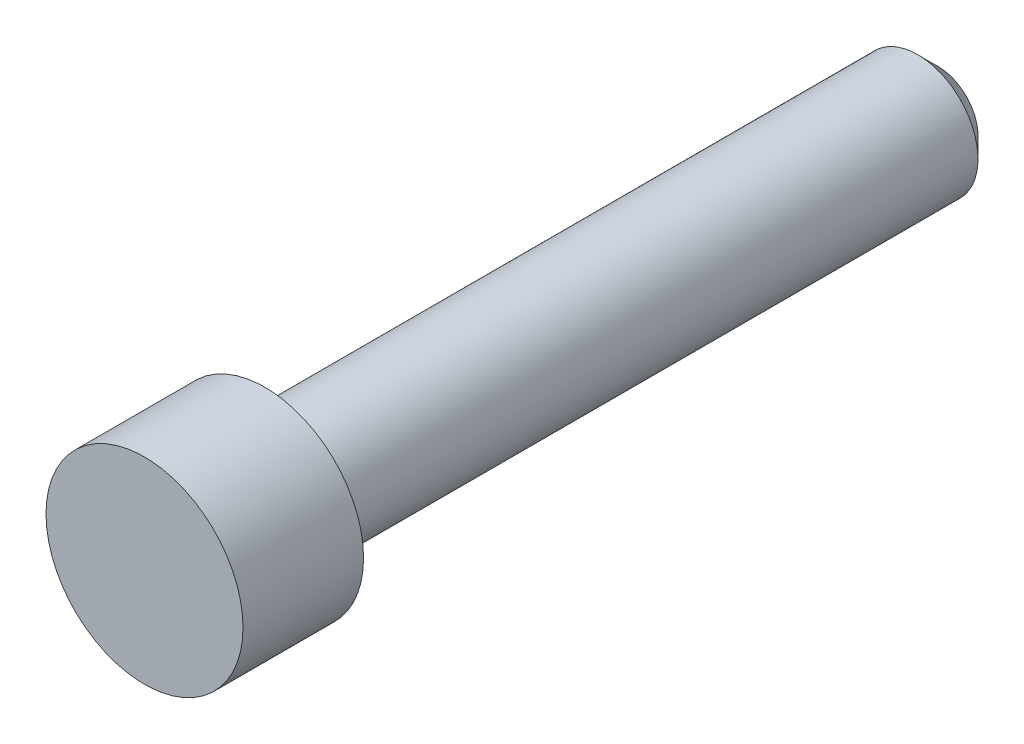
ISO-10303-21;
HEADER;
FILE_DESCRIPTION(('STEP AP214'),'2;1');
FILE_NAME('part.step','',(''),(''),'','','');
FILE_SCHEMA(('AUTOMOTIVE_DESIGN { 1 0 10303 214 1 1 1 1 }'));
ENDSEC;
DATA;
#1=APPLICATION_CONTEXT('core data for automotive mechanical design processes');
#2=APPLICATION_PROTOCOL_DEFINITION('international standard','automotive_design',2000,#1);
#3=PRODUCT_CONTEXT('',#1,'mechanical');
#4=PRODUCT('Part','Part','',(#3));
#5=PRODUCT_RELATED_PRODUCT_CATEGORY('part','',(#4));
#6=PRODUCT_DEFINITION_FORMATION('','',#4);
#7=PRODUCT_DEFINITION_CONTEXT('part definition',#1,'design');
#8=PRODUCT_DEFINITION('design','',#6,#7);
#9=PRODUCT_DEFINITION_SHAPE('','',#8);
#10=(LENGTH_UNIT() NAMED_UNIT(*) SI_UNIT(.MILLI.,.METRE.));
#11=(NAMED_UNIT(*) PLANE_ANGLE_UNIT() SI_UNIT($,.RADIAN.));
#12=(NAMED_UNIT(*) SI_UNIT($,.STERADIAN.) SOLID_ANGLE_UNIT());
#13=UNCERTAINTY_MEASURE_WITH_UNIT(LENGTH_MEASURE(1.E-05),#10,'distance_accuracy_value','');
#14=(GEOMETRIC_REPRESENTATION_CONTEXT(3) GLOBAL_UNCERTAINTY_ASSIGNED_CONTEXT((#13)) GLOBAL_UNIT_ASSIGNED_CONTEXT((#10,
#11,#12)) REPRESENTATION_CONTEXT('',''));
#15=CARTESIAN_POINT('',(0.,0.,0.));
#16=DIRECTION('',(0.,0.,1.));
#17=DIRECTION('',(1.,0.,0.));
#18=AXIS2_PLACEMENT_3D('',#15,#16,#17);
#19=CARTESIAN_POINT('',(0.,2.3241,9.3599));
#20=DIRECTION('',(0.,0.,1.));
#21=DIRECTION('',(1.,0.,0.));
#22=AXIS2_PLACEMENT_3D('',#19,#20,#21);
#23=PLANE('',#22);
#24=CARTESIAN_POINT('',(0.,0.,9.3599));
#25=DIRECTION('',(0.,0.,-1.));
#26=DIRECTION('',(-1.,0.,0.));
#27=AXIS2_PLACEMENT_3D('',#24,#25,#26);
#28=CIRCLE('',#27,2.3241);
#29=CARTESIAN_POINT('',(-2.3241,0.,9.3599));
#30=VERTEX_POINT('',#29);
#31=EDGE_CURVE('E10',#30,#30,#28,.T.);
#32=ORIENTED_EDGE('',*,*,#31,.F.);
#33=EDGE_LOOP('',(#32));
#34=FACE_BOUND('',#33,.T.);
#35=ADVANCED_FACE('F35',(#34),#23,.T.);
#36=CARTESIAN_POINT('',(0.,0.,-9.3599));
#37=DIRECTION('',(0.,0.,-1.));
#38=DIRECTION('',(-1.,0.,0.));
#39=AXIS2_PLACEMENT_3D('',#36,#37,#38);
#40=CYLINDRICAL_SURFACE('',#39,2.3241);
#41=ORIENTED_EDGE('',*,*,#31,.T.);
#42=EDGE_LOOP('',(#41));
#43=FACE_BOUND('',#42,.T.);
#44=CARTESIAN_POINT('',(0.,0.,6.5151));
#45=DIRECTION('',(0.,0.,-1.));
#46=DIRECTION('',(-1.,0.,0.));
#47=AXIS2_PLACEMENT_3D('',#44,#45,#46);
#48=CIRCLE('',#47,2.3241);
#49=CARTESIAN_POINT('',(-2.3241,0.,6.5151));
#50=VERTEX_POINT('',#49);
#51=EDGE_CURVE('E41',#50,#50,#48,.T.);
#52=ORIENTED_EDGE('',*,*,#51,.F.);
#53=EDGE_LOOP('',(#52));
#54=FACE_BOUND('',#53,.T.);
#55=ADVANCED_FACE('F74',(#43,#54),#40,.T.);
#56=CARTESIAN_POINT('',(0.,2.3241,6.5151));
#57=DIRECTION('',(0.,0.,-1.));
#58=DIRECTION('',(-1.,0.,0.));
#59=AXIS2_PLACEMENT_3D('',#56,#57,#58);
#60=PLANE('',#59);
#61=ORIENTED_EDGE('',*,*,#51,.T.);
#62=EDGE_LOOP('',(#61));
#63=FACE_BOUND('',#62,.T.);
#64=CARTESIAN_POINT('',(0.,0.,6.5151));
#65=DIRECTION('',(0.,0.,-1.));
#66=DIRECTION('',(-1.,0.,0.));
#67=AXIS2_PLACEMENT_3D('',#64,#65,#66);
#68=CIRCLE('',#67,1.4224);
#69=CARTESIAN_POINT('',(-1.4224,0.,6.5151));
#70=VERTEX_POINT('',#69);
#71=EDGE_CURVE('E45',#70,#70,#68,.T.);
#72=ORIENTED_EDGE('',*,*,#71,.F.);
#73=EDGE_LOOP('',(#72));
#74=FACE_BOUND('',#73,.T.);
#75=ADVANCED_FACE('F70',(#63,#74),#60,.T.);
#76=CARTESIAN_POINT('',(0.,0.,-9.3599));
#77=DIRECTION('',(0.,0.,-1.));
#78=DIRECTION('',(-1.,0.,0.));
#79=AXIS2_PLACEMENT_3D('',#76,#77,#78);
#80=CYLINDRICAL_SURFACE('',#79,1.4224);
#81=ORIENTED_EDGE('',*,*,#71,.T.);
#82=EDGE_LOOP('',(#81));
#83=FACE_BOUND('',#82,.T.);
#84=CARTESIAN_POINT('',(0.,0.,-8.88365));
#85=DIRECTION('',(0.,0.,-1.));
#86=DIRECTION('',(-1.,0.,0.));
#87=AXIS2_PLACEMENT_3D('',#84,#85,#86);
#88=CIRCLE('',#87,1.4224);
#89=CARTESIAN_POINT('',(-1.4224,0.,-8.88365));
#90=VERTEX_POINT('',#89);
#91=EDGE_CURVE('E49',#90,#90,#88,.T.);
#92=ORIENTED_EDGE('',*,*,#91,.F.);
#93=EDGE_LOOP('',(#92));
#94=FACE_BOUND('',#93,.T.);
#95=ADVANCED_FACE('F62',(#83,#94),#80,.T.);
#96=CARTESIAN_POINT('',(0.,0.,-9.3599));
#97=DIRECTION('',(0.,0.,1.));
#98=DIRECTION('',(1.,0.,0.));
#99=AXIS2_PLACEMENT_3D('',#96,#97,#98);
#100=CONICAL_SURFACE('',#99,0.94615,0.785398163397446);
#101=ORIENTED_EDGE('',*,*,#91,.T.);
#102=EDGE_LOOP('',(#101));
#103=FACE_BOUND('',#102,.T.);
#104=CARTESIAN_POINT('',(0.,0.,-9.3599));
#105=DIRECTION('',(0.,0.,-1.));
#106=DIRECTION('',(-1.,0.,0.));
#107=AXIS2_PLACEMENT_3D('',#104,#105,#106);
#108=CIRCLE('',#107,0.94615);
#109=CARTESIAN_POINT('',(-0.94615,0.,-9.3599));
#110=VERTEX_POINT('',#109);
#111=EDGE_CURVE('E54',#110,#110,#108,.T.);
#112=ORIENTED_EDGE('',*,*,#111,.F.);
#113=EDGE_LOOP('',(#112));
#114=FACE_BOUND('',#113,.T.);
#115=ADVANCED_FACE('F60',(#103,#114),#100,.T.);
#116=CARTESIAN_POINT('',(0.,0.94615,-9.3599));
#117=DIRECTION('',(0.,0.,-1.));
#118=DIRECTION('',(-1.,0.,0.));
#119=AXIS2_PLACEMENT_3D('',#116,#117,#118);
#120=PLANE('',#119);
#121=ORIENTED_EDGE('',*,*,#111,.T.);
#122=EDGE_LOOP('',(#121));
#123=FACE_BOUND('',#122,.T.);
#124=ADVANCED_FACE('F58',(#123),#120,.T.);
#125=CLOSED_SHELL('',(#35,#55,#75,#95,#115,#124));
#126=MANIFOLD_SOLID_BREP('B2',#125);
#127=ADVANCED_BREP_SHAPE_REPRESENTATION('',(#18,#126),#14);
#128=SHAPE_DEFINITION_REPRESENTATION(#9,#127);
ENDSEC;
END-ISO-10303-21;
